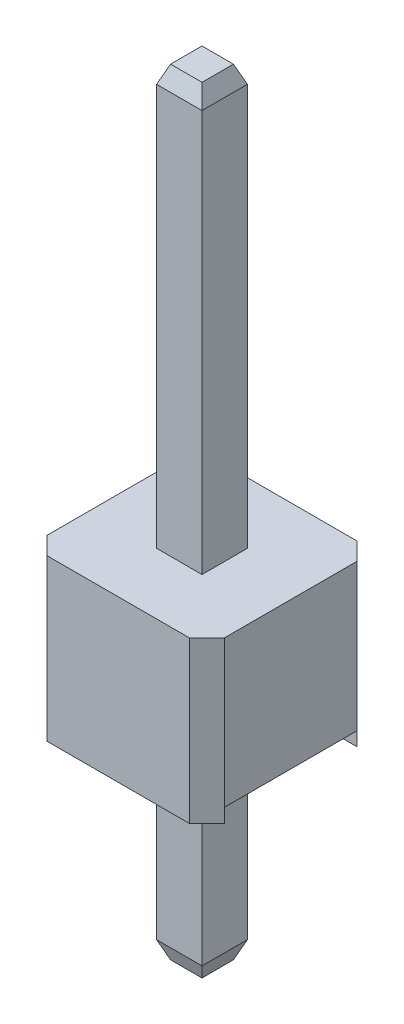
ISO-10303-21;
HEADER;
FILE_DESCRIPTION(('STEP AP214'),'2;1');
FILE_NAME('part.step','',(''),(''),'','','');
FILE_SCHEMA(('AUTOMOTIVE_DESIGN { 1 0 10303 214 1 1 1 1 }'));
ENDSEC;
DATA;
#1=APPLICATION_CONTEXT('core data for automotive mechanical design processes');
#2=APPLICATION_PROTOCOL_DEFINITION('international standard','automotive_design',2000,#1);
#3=PRODUCT_CONTEXT('',#1,'mechanical');
#4=PRODUCT('Part','Part','',(#3));
#5=PRODUCT_RELATED_PRODUCT_CATEGORY('part','',(#4));
#6=PRODUCT_DEFINITION_FORMATION('','',#4);
#7=PRODUCT_DEFINITION_CONTEXT('part definition',#1,'design');
#8=PRODUCT_DEFINITION('design','',#6,#7);
#9=PRODUCT_DEFINITION_SHAPE('','',#8);
#10=(LENGTH_UNIT() NAMED_UNIT(*) SI_UNIT(.MILLI.,.METRE.));
#11=(NAMED_UNIT(*) PLANE_ANGLE_UNIT() SI_UNIT($,.RADIAN.));
#12=(NAMED_UNIT(*) SI_UNIT($,.STERADIAN.) SOLID_ANGLE_UNIT());
#13=UNCERTAINTY_MEASURE_WITH_UNIT(LENGTH_MEASURE(1.E-05),#10,'distance_accuracy_value','');
#14=(GEOMETRIC_REPRESENTATION_CONTEXT(3) GLOBAL_UNCERTAINTY_ASSIGNED_CONTEXT((#13)) GLOBAL_UNIT_ASSIGNED_CONTEXT((#10,
#11,#12)) REPRESENTATION_CONTEXT('',''));
#15=CARTESIAN_POINT('',(0.,0.,0.));
#16=DIRECTION('',(0.,0.,1.));
#17=DIRECTION('',(1.,0.,0.));
#18=AXIS2_PLACEMENT_3D('',#15,#16,#17);
#19=CARTESIAN_POINT('',(-4.405,3.2,1.275));
#20=DIRECTION('',(0.,1.,0.));
#21=DIRECTION('',(1.,0.,0.));
#22=AXIS2_PLACEMENT_3D('',#19,#20,#21);
#23=PLANE('',#22);
#24=DIRECTION('',(0.,0.,-1.));
#25=VECTOR('',#24,1.);
#26=CARTESIAN_POINT('',(-0.945,3.2,-0.875));
#27=LINE('',#26,#25);
#28=CARTESIAN_POINT('',(-0.945,3.2,1.275));
#29=VERTEX_POINT('',#28);
#30=CARTESIAN_POINT('',(-0.945,3.2,-0.625));
#31=VERTEX_POINT('',#30);
#32=EDGE_CURVE('E11',#29,#31,#27,.T.);
#33=ORIENTED_EDGE('',*,*,#32,.T.);
#34=DIRECTION('',(1.,0.,0.));
#35=VECTOR('',#34,1.);
#36=CARTESIAN_POINT('',(-4.405,3.2,-0.625));
#37=LINE('',#36,#35);
#38=CARTESIAN_POINT('',(1.595,3.2,-0.625));
#39=VERTEX_POINT('',#38);
#40=EDGE_CURVE('E28',#31,#39,#37,.T.);
#41=ORIENTED_EDGE('',*,*,#40,.T.);
#42=DIRECTION('',(0.,0.,1.));
#43=VECTOR('',#42,1.);
#44=CARTESIAN_POINT('',(1.595,3.2,1.275));
#45=LINE('',#44,#43);
#46=CARTESIAN_POINT('',(1.595,3.2,1.275));
#47=VERTEX_POINT('',#46);
#48=EDGE_CURVE('E278',#39,#47,#45,.T.);
#49=ORIENTED_EDGE('',*,*,#48,.T.);
#50=DIRECTION('',(1.,0.,0.));
#51=VECTOR('',#50,1.);
#52=CARTESIAN_POINT('',(-4.405,3.2,1.275));
#53=LINE('',#52,#51);
#54=EDGE_CURVE('E317',#29,#47,#53,.T.);
#55=ORIENTED_EDGE('',*,*,#54,.F.);
#56=EDGE_LOOP('',(#33,#41,#49,#55));
#57=FACE_BOUND('',#56,.T.);
#58=DIRECTION('',(0.,0.,-1.));
#59=VECTOR('',#58,1.);
#60=CARTESIAN_POINT('',(0.,3.2,0.));
#61=LINE('',#60,#59);
#62=CARTESIAN_POINT('',(0.,3.2,0.65));
#63=VERTEX_POINT('',#62);
#64=CARTESIAN_POINT('',(0.,3.2,0.));
#65=VERTEX_POINT('',#64);
#66=EDGE_CURVE('E346',#63,#65,#61,.T.);
#67=ORIENTED_EDGE('',*,*,#66,.F.);
#68=DIRECTION('',(-1.,0.,0.));
#69=VECTOR('',#68,1.);
#70=CARTESIAN_POINT('',(0.,3.2,0.65));
#71=LINE('',#70,#69);
#72=CARTESIAN_POINT('',(0.65,3.2,0.65));
#73=VERTEX_POINT('',#72);
#74=EDGE_CURVE('E312',#73,#63,#71,.T.);
#75=ORIENTED_EDGE('',*,*,#74,.F.);
#76=DIRECTION('',(0.,0.,1.));
#77=VECTOR('',#76,1.);
#78=CARTESIAN_POINT('',(0.65,3.2,0.));
#79=LINE('',#78,#77);
#80=CARTESIAN_POINT('',(0.65,3.2,0.));
#81=VERTEX_POINT('',#80);
#82=EDGE_CURVE('E292',#81,#73,#79,.T.);
#83=ORIENTED_EDGE('',*,*,#82,.F.);
#84=DIRECTION('',(1.,0.,0.));
#85=VECTOR('',#84,1.);
#86=CARTESIAN_POINT('',(0.,3.2,0.));
#87=LINE('',#86,#85);
#88=EDGE_CURVE('E21',#65,#81,#87,.T.);
#89=ORIENTED_EDGE('',*,*,#88,.F.);
#90=EDGE_LOOP('',(#67,#75,#83,#89));
#91=FACE_BOUND('',#90,.T.);
#92=ADVANCED_FACE('F17',(#57,#91),#23,.F.);
#93=CARTESIAN_POINT('',(0.,3.,0.));
#94=DIRECTION('',(0.,-1.,0.));
#95=DIRECTION('',(0.,0.,-1.));
#96=AXIS2_PLACEMENT_3D('',#93,#94,#95);
#97=PLANE('',#96);
#98=DIRECTION('',(1.,0.,0.));
#99=VECTOR('',#98,1.);
#100=CARTESIAN_POINT('',(-4.405,3.,1.275));
#101=LINE('',#100,#99);
#102=CARTESIAN_POINT('',(-0.945,3.,1.275));
#103=VERTEX_POINT('',#102);
#104=CARTESIAN_POINT('',(1.595,3.,1.275));
#105=VERTEX_POINT('',#104);
#106=EDGE_CURVE('E282',#103,#105,#101,.T.);
#107=ORIENTED_EDGE('',*,*,#106,.T.);
#108=DIRECTION('',(-0.70710678118655,0.,0.707106781186545));
#109=VECTOR('',#108,1.);
#110=CARTESIAN_POINT('',(1.435,3.,1.435));
#111=LINE('',#110,#109);
#112=CARTESIAN_POINT('',(1.345,3.,1.525));
#113=VERTEX_POINT('',#112);
#114=EDGE_CURVE('E353',#105,#113,#111,.T.);
#115=ORIENTED_EDGE('',*,*,#114,.T.);
#116=DIRECTION('',(-1.,0.,0.));
#117=VECTOR('',#116,1.);
#118=CARTESIAN_POINT('',(1.595,3.,1.525));
#119=LINE('',#118,#117);
#120=CARTESIAN_POINT('',(-0.695,3.,1.525));
#121=VERTEX_POINT('',#120);
#122=EDGE_CURVE('E255',#113,#121,#119,.T.);
#123=ORIENTED_EDGE('',*,*,#122,.T.);
#124=DIRECTION('',(-0.707106781186548,0.,-0.707106781186548));
#125=VECTOR('',#124,1.);
#126=CARTESIAN_POINT('',(-1.11,3.,1.11));
#127=LINE('',#126,#125);
#128=EDGE_CURVE('E354',#121,#103,#127,.T.);
#129=ORIENTED_EDGE('',*,*,#128,.T.);
#130=EDGE_LOOP('',(#107,#115,#123,#129));
#131=FACE_BOUND('',#130,.T.);
#132=ADVANCED_FACE('F515',(#131),#97,.T.);
#133=CARTESIAN_POINT('',(0.,11.3,0.));
#134=DIRECTION('',(1.,0.,0.));
#135=DIRECTION('',(0.,1.,0.));
#136=AXIS2_PLACEMENT_3D('',#133,#134,#135);
#137=PLANE('',#136);
#138=DIRECTION('',(0.,0.,-1.));
#139=VECTOR('',#138,1.);
#140=CARTESIAN_POINT('',(0.,5.3,0.));
#141=LINE('',#140,#139);
#142=CARTESIAN_POINT('',(0.,5.3,0.65));
#143=VERTEX_POINT('',#142);
#144=CARTESIAN_POINT('',(0.,5.3,0.));
#145=VERTEX_POINT('',#144);
#146=EDGE_CURVE('E359',#143,#145,#141,.T.);
#147=ORIENTED_EDGE('',*,*,#146,.F.);
#148=DIRECTION('',(0.,-1.,0.));
#149=VECTOR('',#148,1.);
#150=CARTESIAN_POINT('',(0.,11.3,0.65));
#151=LINE('',#150,#149);
#152=CARTESIAN_POINT('',(0.,11.05,0.65));
#153=VERTEX_POINT('',#152);
#154=EDGE_CURVE('E368',#153,#143,#151,.T.);
#155=ORIENTED_EDGE('',*,*,#154,.F.);
#156=DIRECTION('',(0.,0.,-1.));
#157=VECTOR('',#156,1.);
#158=CARTESIAN_POINT('',(0.,11.05,0.));
#159=LINE('',#158,#157);
#160=CARTESIAN_POINT('',(0.,11.05,0.));
#161=VERTEX_POINT('',#160);
#162=EDGE_CURVE('E402',#153,#161,#159,.T.);
#163=ORIENTED_EDGE('',*,*,#162,.T.);
#164=DIRECTION('',(0.,-1.,0.));
#165=VECTOR('',#164,1.);
#166=CARTESIAN_POINT('',(0.,11.3,0.));
#167=LINE('',#166,#165);
#168=EDGE_CURVE('E398',#161,#145,#167,.T.);
#169=ORIENTED_EDGE('',*,*,#168,.T.);
#170=EDGE_LOOP('',(#147,#155,#163,#169));
#171=FACE_BOUND('',#170,.T.);
#172=ADVANCED_FACE('F884',(#171),#137,.F.);
#173=CARTESIAN_POINT('',(0.,11.3,0.65));
#174=DIRECTION('',(0.,0.,-1.));
#175=DIRECTION('',(0.,-1.,0.));
#176=AXIS2_PLACEMENT_3D('',#173,#174,#175);
#177=PLANE('',#176);
#178=DIRECTION('',(-1.,0.,0.));
#179=VECTOR('',#178,1.);
#180=CARTESIAN_POINT('',(0.,5.3,0.65));
#181=LINE('',#180,#179);
#182=CARTESIAN_POINT('',(0.65,5.3,0.65));
#183=VERTEX_POINT('',#182);
#184=EDGE_CURVE('E355',#183,#143,#181,.T.);
#185=ORIENTED_EDGE('',*,*,#184,.F.);
#186=DIRECTION('',(0.,-1.,0.));
#187=VECTOR('',#186,1.);
#188=CARTESIAN_POINT('',(0.65,11.3,0.65));
#189=LINE('',#188,#187);
#190=CARTESIAN_POINT('',(0.65,11.05,0.65));
#191=VERTEX_POINT('',#190);
#192=EDGE_CURVE('E298',#191,#183,#189,.T.);
#193=ORIENTED_EDGE('',*,*,#192,.F.);
#194=DIRECTION('',(-1.,0.,0.));
#195=VECTOR('',#194,1.);
#196=CARTESIAN_POINT('',(0.,11.05,0.65));
#197=LINE('',#196,#195);
#198=EDGE_CURVE('E372',#191,#153,#197,.T.);
#199=ORIENTED_EDGE('',*,*,#198,.T.);
#200=ORIENTED_EDGE('',*,*,#154,.T.);
#201=EDGE_LOOP('',(#185,#193,#199,#200));
#202=FACE_BOUND('',#201,.T.);
#203=ADVANCED_FACE('F834',(#202),#177,.F.);
#204=CARTESIAN_POINT('',(0.65,11.3,0.));
#205=DIRECTION('',(-1.,0.,0.));
#206=DIRECTION('',(0.,1.,0.));
#207=AXIS2_PLACEMENT_3D('',#204,#205,#206);
#208=PLANE('',#207);
#209=DIRECTION('',(0.,0.,1.));
#210=VECTOR('',#209,1.);
#211=CARTESIAN_POINT('',(0.65,5.3,0.));
#212=LINE('',#211,#210);
#213=CARTESIAN_POINT('',(0.65,5.3,0.));
#214=VERTEX_POINT('',#213);
#215=EDGE_CURVE('E417',#214,#183,#212,.T.);
#216=ORIENTED_EDGE('',*,*,#215,.F.);
#217=DIRECTION('',(0.,-1.,0.));
#218=VECTOR('',#217,1.);
#219=CARTESIAN_POINT('',(0.65,11.3,0.));
#220=LINE('',#219,#218);
#221=CARTESIAN_POINT('',(0.65,11.05,0.));
#222=VERTEX_POINT('',#221);
#223=EDGE_CURVE('E299',#222,#214,#220,.T.);
#224=ORIENTED_EDGE('',*,*,#223,.F.);
#225=DIRECTION('',(0.,0.,1.));
#226=VECTOR('',#225,1.);
#227=CARTESIAN_POINT('',(0.65,11.05,0.65));
#228=LINE('',#227,#226);
#229=EDGE_CURVE('E350',#222,#191,#228,.T.);
#230=ORIENTED_EDGE('',*,*,#229,.T.);
#231=ORIENTED_EDGE('',*,*,#192,.T.);
#232=EDGE_LOOP('',(#216,#224,#230,#231));
#233=FACE_BOUND('',#232,.T.);
#234=ADVANCED_FACE('F829',(#233),#208,.F.);
#235=CARTESIAN_POINT('',(0.,11.3,0.));
#236=DIRECTION('',(0.,0.,1.));
#237=DIRECTION('',(1.,0.,0.));
#238=AXIS2_PLACEMENT_3D('',#235,#236,#237);
#239=PLANE('',#238);
#240=DIRECTION('',(1.,0.,0.));
#241=VECTOR('',#240,1.);
#242=CARTESIAN_POINT('',(0.,5.3,0.));
#243=LINE('',#242,#241);
#244=EDGE_CURVE('E418',#145,#214,#243,.T.);
#245=ORIENTED_EDGE('',*,*,#244,.F.);
#246=ORIENTED_EDGE('',*,*,#168,.F.);
#247=DIRECTION('',(1.,0.,0.));
#248=VECTOR('',#247,1.);
#249=CARTESIAN_POINT('',(0.65,11.05,0.));
#250=LINE('',#249,#248);
#251=EDGE_CURVE('E294',#161,#222,#250,.T.);
#252=ORIENTED_EDGE('',*,*,#251,.T.);
#253=ORIENTED_EDGE('',*,*,#223,.T.);
#254=EDGE_LOOP('',(#245,#246,#252,#253));
#255=FACE_BOUND('',#254,.T.);
#256=ADVANCED_FACE('F833',(#255),#239,.F.);
#257=CARTESIAN_POINT('',(0.,11.3,0.));
#258=DIRECTION('',(0.,1.,0.));
#259=DIRECTION('',(1.,0.,0.));
#260=AXIS2_PLACEMENT_3D('',#257,#258,#259);
#261=PLANE('',#260);
#262=DIRECTION('',(0.,0.,-1.));
#263=VECTOR('',#262,1.);
#264=CARTESIAN_POINT('',(0.55,11.3,0.));
#265=LINE('',#264,#263);
#266=CARTESIAN_POINT('',(0.55,11.3,0.55));
#267=VERTEX_POINT('',#266);
#268=CARTESIAN_POINT('',(0.55,11.3,0.1));
#269=VERTEX_POINT('',#268);
#270=EDGE_CURVE('E304',#267,#269,#265,.T.);
#271=ORIENTED_EDGE('',*,*,#270,.T.);
#272=DIRECTION('',(-1.,0.,0.));
#273=VECTOR('',#272,1.);
#274=CARTESIAN_POINT('',(0.,11.3,0.1));
#275=LINE('',#274,#273);
#276=CARTESIAN_POINT('',(0.1,11.3,0.1));
#277=VERTEX_POINT('',#276);
#278=EDGE_CURVE('E300',#269,#277,#275,.T.);
#279=ORIENTED_EDGE('',*,*,#278,.T.);
#280=DIRECTION('',(0.,0.,1.));
#281=VECTOR('',#280,1.);
#282=CARTESIAN_POINT('',(0.1,11.3,0.65));
#283=LINE('',#282,#281);
#284=CARTESIAN_POINT('',(0.1,11.3,0.55));
#285=VERTEX_POINT('',#284);
#286=EDGE_CURVE('E305',#277,#285,#283,.T.);
#287=ORIENTED_EDGE('',*,*,#286,.T.);
#288=DIRECTION('',(1.,0.,0.));
#289=VECTOR('',#288,1.);
#290=CARTESIAN_POINT('',(0.65,11.3,0.55));
#291=LINE('',#290,#289);
#292=EDGE_CURVE('E412',#285,#267,#291,.T.);
#293=ORIENTED_EDGE('',*,*,#292,.T.);
#294=EDGE_LOOP('',(#271,#279,#287,#293));
#295=FACE_BOUND('',#294,.T.);
#296=ADVANCED_FACE('F951',(#295),#261,.T.);
#297=CARTESIAN_POINT('',(0.,11.3,0.55));
#298=DIRECTION('',(0.,0.371390676354102,0.92847669088526));
#299=DIRECTION('',(1.,0.,0.));
#300=AXIS2_PLACEMENT_3D('',#297,#298,#299);
#301=PLANE('',#300);
#302=DIRECTION('',(0.348155311911395,0.87038827977849,-0.348155311911395));
#303=VECTOR('',#302,1.);
#304=CARTESIAN_POINT('',(0.166666666666666,11.4666666666667,0.483333333333334));
#305=LINE('',#304,#303);
#306=EDGE_CURVE('E430',#153,#285,#305,.T.);
#307=ORIENTED_EDGE('',*,*,#306,.F.);
#308=ORIENTED_EDGE('',*,*,#198,.F.);
#309=DIRECTION('',(0.348155311911395,-0.87038827977849,0.348155311911395));
#310=VECTOR('',#309,1.);
#311=CARTESIAN_POINT('',(0.483333333333334,11.4666666666667,0.483333333333334));
#312=LINE('',#311,#310);
#313=EDGE_CURVE('E434',#267,#191,#312,.T.);
#314=ORIENTED_EDGE('',*,*,#313,.F.);
#315=ORIENTED_EDGE('',*,*,#292,.F.);
#316=EDGE_LOOP('',(#307,#308,#314,#315));
#317=FACE_BOUND('',#316,.T.);
#318=ADVANCED_FACE('F955',(#317),#301,.T.);
#319=CARTESIAN_POINT('',(0.55,11.3,0.));
#320=DIRECTION('',(0.92847669088526,0.371390676354102,0.));
#321=DIRECTION('',(0.,0.,-1.));
#322=AXIS2_PLACEMENT_3D('',#319,#320,#321);
#323=PLANE('',#322);
#324=ORIENTED_EDGE('',*,*,#313,.T.);
#325=ORIENTED_EDGE('',*,*,#229,.F.);
#326=DIRECTION('',(0.348155311911395,-0.87038827977849,-0.348155311911395));
#327=VECTOR('',#326,1.);
#328=CARTESIAN_POINT('',(0.562121212121212,11.269696969697,0.0878787878787882));
#329=LINE('',#328,#327);
#330=EDGE_CURVE('E435',#269,#222,#329,.T.);
#331=ORIENTED_EDGE('',*,*,#330,.F.);
#332=ORIENTED_EDGE('',*,*,#270,.F.);
#333=EDGE_LOOP('',(#324,#325,#331,#332));
#334=FACE_BOUND('',#333,.T.);
#335=ADVANCED_FACE('F908',(#334),#323,.T.);
#336=CARTESIAN_POINT('',(0.1,11.3,0.));
#337=DIRECTION('',(-0.92847669088526,0.371390676354102,0.));
#338=DIRECTION('',(0.,0.,1.));
#339=AXIS2_PLACEMENT_3D('',#336,#337,#338);
#340=PLANE('',#339);
#341=ORIENTED_EDGE('',*,*,#306,.T.);
#342=ORIENTED_EDGE('',*,*,#286,.F.);
#343=DIRECTION('',(0.348155311911395,0.87038827977849,0.348155311911395));
#344=VECTOR('',#343,1.);
#345=CARTESIAN_POINT('',(0.0878787878787882,11.269696969697,0.0878787878787882));
#346=LINE('',#345,#344);
#347=EDGE_CURVE('E390',#161,#277,#346,.T.);
#348=ORIENTED_EDGE('',*,*,#347,.F.);
#349=ORIENTED_EDGE('',*,*,#162,.F.);
#350=EDGE_LOOP('',(#341,#342,#348,#349));
#351=FACE_BOUND('',#350,.T.);
#352=ADVANCED_FACE('F903',(#351),#340,.T.);
#353=CARTESIAN_POINT('',(0.,11.3,0.1));
#354=DIRECTION('',(0.,0.371390676354102,-0.92847669088526));
#355=DIRECTION('',(-1.,0.,0.));
#356=AXIS2_PLACEMENT_3D('',#353,#354,#355);
#357=PLANE('',#356);
#358=ORIENTED_EDGE('',*,*,#330,.T.);
#359=ORIENTED_EDGE('',*,*,#251,.F.);
#360=ORIENTED_EDGE('',*,*,#347,.T.);
#361=ORIENTED_EDGE('',*,*,#278,.F.);
#362=EDGE_LOOP('',(#358,#359,#360,#361));
#363=FACE_BOUND('',#362,.T.);
#364=ADVANCED_FACE('F907',(#363),#357,.T.);
#365=CARTESIAN_POINT('',(0.,5.3,0.));
#366=DIRECTION('',(0.,-1.,0.));
#367=DIRECTION('',(0.,0.,-1.));
#368=AXIS2_PLACEMENT_3D('',#365,#366,#367);
#369=PLANE('',#368);
#370=DIRECTION('',(1.,0.,0.));
#371=VECTOR('',#370,1.);
#372=CARTESIAN_POINT('',(1.595,5.3,-0.875));
#373=LINE('',#372,#371);
#374=CARTESIAN_POINT('',(-0.695,5.3,-0.875));
#375=VERTEX_POINT('',#374);
#376=CARTESIAN_POINT('',(1.345,5.3,-0.875));
#377=VERTEX_POINT('',#376);
#378=EDGE_CURVE('E364',#375,#377,#373,.T.);
#379=ORIENTED_EDGE('',*,*,#378,.F.);
#380=DIRECTION('',(-0.707106781186548,0.,0.707106781186548));
#381=VECTOR('',#380,1.);
#382=CARTESIAN_POINT('',(-0.945,5.3,-0.625));
#383=LINE('',#382,#381);
#384=CARTESIAN_POINT('',(-0.945,5.3,-0.625));
#385=VERTEX_POINT('',#384);
#386=EDGE_CURVE('E387',#375,#385,#383,.T.);
#387=ORIENTED_EDGE('',*,*,#386,.T.);
#388=DIRECTION('',(0.,0.,-1.));
#389=VECTOR('',#388,1.);
#390=CARTESIAN_POINT('',(-0.945,5.3,-0.875));
#391=LINE('',#390,#389);
#392=CARTESIAN_POINT('',(-0.945,5.3,1.275));
#393=VERTEX_POINT('',#392);
#394=EDGE_CURVE('E271',#393,#385,#391,.T.);
#395=ORIENTED_EDGE('',*,*,#394,.F.);
#396=DIRECTION('',(0.707106781186548,0.,0.707106781186548));
#397=VECTOR('',#396,1.);
#398=CARTESIAN_POINT('',(-0.695,5.3,1.525));
#399=LINE('',#398,#397);
#400=CARTESIAN_POINT('',(-0.695,5.3,1.525));
#401=VERTEX_POINT('',#400);
#402=EDGE_CURVE('E235',#393,#401,#399,.T.);
#403=ORIENTED_EDGE('',*,*,#402,.T.);
#404=DIRECTION('',(-1.,0.,0.));
#405=VECTOR('',#404,1.);
#406=CARTESIAN_POINT('',(1.595,5.3,1.525));
#407=LINE('',#406,#405);
#408=CARTESIAN_POINT('',(1.345,5.3,1.525));
#409=VERTEX_POINT('',#408);
#410=EDGE_CURVE('E228',#409,#401,#407,.T.);
#411=ORIENTED_EDGE('',*,*,#410,.F.);
#412=DIRECTION('',(0.70710678118655,0.,-0.707106781186545));
#413=VECTOR('',#412,1.);
#414=CARTESIAN_POINT('',(1.595,5.3,1.275));
#415=LINE('',#414,#413);
#416=CARTESIAN_POINT('',(1.595,5.3,1.275));
#417=VERTEX_POINT('',#416);
#418=EDGE_CURVE('E232',#409,#417,#415,.T.);
#419=ORIENTED_EDGE('',*,*,#418,.T.);
#420=DIRECTION('',(0.,0.,1.));
#421=VECTOR('',#420,1.);
#422=CARTESIAN_POINT('',(1.595,5.3,-0.875));
#423=LINE('',#422,#421);
#424=CARTESIAN_POINT('',(1.595,5.3,-0.625));
#425=VERTEX_POINT('',#424);
#426=EDGE_CURVE('E308',#425,#417,#423,.T.);
#427=ORIENTED_EDGE('',*,*,#426,.F.);
#428=DIRECTION('',(-0.707106781186545,0.,-0.70710678118655));
#429=VECTOR('',#428,1.);
#430=CARTESIAN_POINT('',(1.345,5.3,-0.875));
#431=LINE('',#430,#429);
#432=EDGE_CURVE('E251',#425,#377,#431,.T.);
#433=ORIENTED_EDGE('',*,*,#432,.T.);
#434=EDGE_LOOP('',(#379,#387,#395,#403,#411,#419,#427,#433));
#435=FACE_BOUND('',#434,.T.);
#436=ORIENTED_EDGE('',*,*,#184,.T.);
#437=ORIENTED_EDGE('',*,*,#146,.T.);
#438=ORIENTED_EDGE('',*,*,#244,.T.);
#439=ORIENTED_EDGE('',*,*,#215,.T.);
#440=EDGE_LOOP('',(#436,#437,#438,#439));
#441=FACE_BOUND('',#440,.T.);
#442=ADVANCED_FACE('F19',(#435,#441),#369,.F.);
#443=CARTESIAN_POINT('',(0.,3.,0.));
#444=DIRECTION('',(0.,-1.,0.));
#445=DIRECTION('',(0.,0.,-1.));
#446=AXIS2_PLACEMENT_3D('',#443,#444,#445);
#447=PLANE('',#446);
#448=DIRECTION('',(1.,0.,0.));
#449=VECTOR('',#448,1.);
#450=CARTESIAN_POINT('',(-4.405,3.,-0.625));
#451=LINE('',#450,#449);
#452=CARTESIAN_POINT('',(-0.945,3.,-0.625));
#453=VERTEX_POINT('',#452);
#454=CARTESIAN_POINT('',(1.595,3.,-0.625));
#455=VERTEX_POINT('',#454);
#456=EDGE_CURVE('E159',#453,#455,#451,.T.);
#457=ORIENTED_EDGE('',*,*,#456,.F.);
#458=DIRECTION('',(0.707106781186548,0.,-0.707106781186548));
#459=VECTOR('',#458,1.);
#460=CARTESIAN_POINT('',(-0.785,3.,-0.785));
#461=LINE('',#460,#459);
#462=CARTESIAN_POINT('',(-0.695,3.,-0.875));
#463=VERTEX_POINT('',#462);
#464=EDGE_CURVE('E413',#453,#463,#461,.T.);
#465=ORIENTED_EDGE('',*,*,#464,.T.);
#466=DIRECTION('',(1.,0.,0.));
#467=VECTOR('',#466,1.);
#468=CARTESIAN_POINT('',(1.595,3.,-0.875));
#469=LINE('',#468,#467);
#470=CARTESIAN_POINT('',(1.345,3.,-0.875));
#471=VERTEX_POINT('',#470);
#472=EDGE_CURVE('E315',#463,#471,#469,.T.);
#473=ORIENTED_EDGE('',*,*,#472,.T.);
#474=DIRECTION('',(0.707106781186545,0.,0.70710678118655));
#475=VECTOR('',#474,1.);
#476=CARTESIAN_POINT('',(1.11,3.,-1.11));
#477=LINE('',#476,#475);
#478=EDGE_CURVE('E142',#471,#455,#477,.T.);
#479=ORIENTED_EDGE('',*,*,#478,.T.);
#480=EDGE_LOOP('',(#457,#465,#473,#479));
#481=FACE_BOUND('',#480,.T.);
#482=ADVANCED_FACE('F1007',(#481),#447,.T.);
#483=CARTESIAN_POINT('',(1.595,5.3,-0.875));
#484=DIRECTION('',(1.,0.,0.));
#485=DIRECTION('',(0.,1.,0.));
#486=AXIS2_PLACEMENT_3D('',#483,#484,#485);
#487=PLANE('',#486);
#488=ORIENTED_EDGE('',*,*,#48,.F.);
#489=DIRECTION('',(0.,1.,0.));
#490=VECTOR('',#489,1.);
#491=CARTESIAN_POINT('',(1.595,5.3,-0.625));
#492=LINE('',#491,#490);
#493=EDGE_CURVE('E316',#39,#425,#492,.T.);
#494=ORIENTED_EDGE('',*,*,#493,.T.);
#495=ORIENTED_EDGE('',*,*,#426,.T.);
#496=DIRECTION('',(0.,-1.,0.));
#497=VECTOR('',#496,1.);
#498=CARTESIAN_POINT('',(1.595,5.3,1.275));
#499=LINE('',#498,#497);
#500=EDGE_CURVE('E249',#417,#47,#499,.T.);
#501=ORIENTED_EDGE('',*,*,#500,.T.);
#502=EDGE_LOOP('',(#488,#494,#495,#501));
#503=FACE_BOUND('',#502,.T.);
#504=ADVANCED_FACE('F523',(#503),#487,.T.);
#505=CARTESIAN_POINT('',(1.595,5.3,-0.875));
#506=DIRECTION('',(0.,0.,-1.));
#507=DIRECTION('',(0.,-1.,0.));
#508=AXIS2_PLACEMENT_3D('',#505,#506,#507);
#509=PLANE('',#508);
#510=ORIENTED_EDGE('',*,*,#472,.F.);
#511=DIRECTION('',(0.,1.,0.));
#512=VECTOR('',#511,1.);
#513=CARTESIAN_POINT('',(-0.695,5.3,-0.875));
#514=LINE('',#513,#512);
#515=EDGE_CURVE('E269',#463,#375,#514,.T.);
#516=ORIENTED_EDGE('',*,*,#515,.T.);
#517=ORIENTED_EDGE('',*,*,#378,.T.);
#518=DIRECTION('',(0.,-1.,0.));
#519=VECTOR('',#518,1.);
#520=CARTESIAN_POINT('',(1.345,5.3,-0.875));
#521=LINE('',#520,#519);
#522=EDGE_CURVE('E360',#377,#471,#521,.T.);
#523=ORIENTED_EDGE('',*,*,#522,.T.);
#524=EDGE_LOOP('',(#510,#516,#517,#523));
#525=FACE_BOUND('',#524,.T.);
#526=ADVANCED_FACE('F533',(#525),#509,.T.);
#527=CARTESIAN_POINT('',(-0.945,5.3,-0.875));
#528=DIRECTION('',(-1.,0.,0.));
#529=DIRECTION('',(0.,0.,1.));
#530=AXIS2_PLACEMENT_3D('',#527,#528,#529);
#531=PLANE('',#530);
#532=ORIENTED_EDGE('',*,*,#32,.F.);
#533=DIRECTION('',(0.,1.,0.));
#534=VECTOR('',#533,1.);
#535=CARTESIAN_POINT('',(-0.945,5.3,1.275));
#536=LINE('',#535,#534);
#537=EDGE_CURVE('E274',#29,#393,#536,.T.);
#538=ORIENTED_EDGE('',*,*,#537,.T.);
#539=ORIENTED_EDGE('',*,*,#394,.T.);
#540=DIRECTION('',(0.,-1.,0.));
#541=VECTOR('',#540,1.);
#542=CARTESIAN_POINT('',(-0.945,5.3,-0.625));
#543=LINE('',#542,#541);
#544=EDGE_CURVE('E43',#385,#31,#543,.T.);
#545=ORIENTED_EDGE('',*,*,#544,.T.);
#546=EDGE_LOOP('',(#532,#538,#539,#545));
#547=FACE_BOUND('',#546,.T.);
#548=ADVANCED_FACE('F917',(#547),#531,.T.);
#549=CARTESIAN_POINT('',(1.595,5.3,1.525));
#550=DIRECTION('',(0.,0.,1.));
#551=DIRECTION('',(1.,0.,0.));
#552=AXIS2_PLACEMENT_3D('',#549,#550,#551);
#553=PLANE('',#552);
#554=ORIENTED_EDGE('',*,*,#410,.T.);
#555=DIRECTION('',(0.,-1.,0.));
#556=VECTOR('',#555,1.);
#557=CARTESIAN_POINT('',(-0.695,5.3,1.525));
#558=LINE('',#557,#556);
#559=EDGE_CURVE('E241',#401,#121,#558,.T.);
#560=ORIENTED_EDGE('',*,*,#559,.T.);
#561=ORIENTED_EDGE('',*,*,#122,.F.);
#562=DIRECTION('',(0.,1.,0.));
#563=VECTOR('',#562,1.);
#564=CARTESIAN_POINT('',(1.345,5.3,1.525));
#565=LINE('',#564,#563);
#566=EDGE_CURVE('E246',#113,#409,#565,.T.);
#567=ORIENTED_EDGE('',*,*,#566,.T.);
#568=EDGE_LOOP('',(#554,#560,#561,#567));
#569=FACE_BOUND('',#568,.T.);
#570=ADVANCED_FACE('F253',(#569),#553,.T.);
#571=CARTESIAN_POINT('',(-0.945,5.3,-0.625));
#572=DIRECTION('',(0.707106781186548,0.,0.707106781186548));
#573=DIRECTION('',(0.,-1.,0.));
#574=AXIS2_PLACEMENT_3D('',#571,#572,#573);
#575=PLANE('',#574);
#576=ORIENTED_EDGE('',*,*,#386,.F.);
#577=ORIENTED_EDGE('',*,*,#515,.F.);
#578=ORIENTED_EDGE('',*,*,#464,.F.);
#579=DIRECTION('',(0.,-1.,0.));
#580=VECTOR('',#579,1.);
#581=CARTESIAN_POINT('',(-0.945,5.3,-0.625));
#582=LINE('',#581,#580);
#583=EDGE_CURVE('E258',#31,#453,#582,.T.);
#584=ORIENTED_EDGE('',*,*,#583,.F.);
#585=ORIENTED_EDGE('',*,*,#544,.F.);
#586=EDGE_LOOP('',(#576,#577,#578,#584,#585));
#587=FACE_BOUND('',#586,.T.);
#588=ADVANCED_FACE('F817',(#587),#575,.F.);
#589=CARTESIAN_POINT('',(-0.695,5.3,1.525));
#590=DIRECTION('',(0.707106781186548,0.,-0.707106781186548));
#591=DIRECTION('',(0.,-1.,0.));
#592=AXIS2_PLACEMENT_3D('',#589,#590,#591);
#593=PLANE('',#592);
#594=ORIENTED_EDGE('',*,*,#402,.F.);
#595=ORIENTED_EDGE('',*,*,#537,.F.);
#596=DIRECTION('',(0.,1.,0.));
#597=VECTOR('',#596,1.);
#598=CARTESIAN_POINT('',(-0.945,5.3,1.275));
#599=LINE('',#598,#597);
#600=EDGE_CURVE('E320',#103,#29,#599,.T.);
#601=ORIENTED_EDGE('',*,*,#600,.F.);
#602=ORIENTED_EDGE('',*,*,#128,.F.);
#603=ORIENTED_EDGE('',*,*,#559,.F.);
#604=EDGE_LOOP('',(#594,#595,#601,#602,#603));
#605=FACE_BOUND('',#604,.T.);
#606=ADVANCED_FACE('F821',(#605),#593,.F.);
#607=CARTESIAN_POINT('',(1.595,5.3,1.275));
#608=DIRECTION('',(-0.707106781186545,0.,-0.70710678118655));
#609=DIRECTION('',(-0.70710678118655,0.,0.707106781186545));
#610=AXIS2_PLACEMENT_3D('',#607,#608,#609);
#611=PLANE('',#610);
#612=ORIENTED_EDGE('',*,*,#418,.F.);
#613=ORIENTED_EDGE('',*,*,#566,.F.);
#614=ORIENTED_EDGE('',*,*,#114,.F.);
#615=DIRECTION('',(0.,-1.,0.));
#616=VECTOR('',#615,1.);
#617=CARTESIAN_POINT('',(1.595,3.,1.275));
#618=LINE('',#617,#616);
#619=EDGE_CURVE('E321',#47,#105,#618,.T.);
#620=ORIENTED_EDGE('',*,*,#619,.F.);
#621=ORIENTED_EDGE('',*,*,#500,.F.);
#622=EDGE_LOOP('',(#612,#613,#614,#620,#621));
#623=FACE_BOUND('',#622,.T.);
#624=ADVANCED_FACE('F245',(#623),#611,.F.);
#625=CARTESIAN_POINT('',(1.345,5.3,-0.875));
#626=DIRECTION('',(-0.70710678118655,0.,0.707106781186545));
#627=DIRECTION('',(0.,1.,0.));
#628=AXIS2_PLACEMENT_3D('',#625,#626,#627);
#629=PLANE('',#628);
#630=ORIENTED_EDGE('',*,*,#432,.F.);
#631=ORIENTED_EDGE('',*,*,#493,.F.);
#632=DIRECTION('',(0.,1.,0.));
#633=VECTOR('',#632,1.);
#634=CARTESIAN_POINT('',(1.595,5.3,-0.625));
#635=LINE('',#634,#633);
#636=EDGE_CURVE('E375',#455,#39,#635,.T.);
#637=ORIENTED_EDGE('',*,*,#636,.F.);
#638=ORIENTED_EDGE('',*,*,#478,.F.);
#639=ORIENTED_EDGE('',*,*,#522,.F.);
#640=EDGE_LOOP('',(#630,#631,#637,#638,#639));
#641=FACE_BOUND('',#640,.T.);
#642=ADVANCED_FACE('F528',(#641),#629,.F.);
#643=CARTESIAN_POINT('',(-4.405,3.,-0.625));
#644=DIRECTION('',(0.,0.,-1.));
#645=DIRECTION('',(0.,-1.,0.));
#646=AXIS2_PLACEMENT_3D('',#643,#644,#645);
#647=PLANE('',#646);
#648=ORIENTED_EDGE('',*,*,#583,.T.);
#649=ORIENTED_EDGE('',*,*,#456,.T.);
#650=ORIENTED_EDGE('',*,*,#636,.T.);
#651=ORIENTED_EDGE('',*,*,#40,.F.);
#652=EDGE_LOOP('',(#648,#649,#650,#651));
#653=FACE_BOUND('',#652,.T.);
#654=ADVANCED_FACE('F526',(#653),#647,.F.);
#655=CARTESIAN_POINT('',(-4.405,3.,1.275));
#656=DIRECTION('',(0.,0.,1.));
#657=DIRECTION('',(1.,0.,0.));
#658=AXIS2_PLACEMENT_3D('',#655,#656,#657);
#659=PLANE('',#658);
#660=ORIENTED_EDGE('',*,*,#600,.T.);
#661=ORIENTED_EDGE('',*,*,#54,.T.);
#662=ORIENTED_EDGE('',*,*,#619,.T.);
#663=ORIENTED_EDGE('',*,*,#106,.F.);
#664=EDGE_LOOP('',(#660,#661,#662,#663));
#665=FACE_BOUND('',#664,.T.);
#666=ADVANCED_FACE('F518',(#665),#659,.F.);
#667=CARTESIAN_POINT('',(0.,0.2,0.));
#668=DIRECTION('',(1.,0.,0.));
#669=DIRECTION('',(0.,1.,0.));
#670=AXIS2_PLACEMENT_3D('',#667,#668,#669);
#671=PLANE('',#670);
#672=DIRECTION('',(0.,1.,0.));
#673=VECTOR('',#672,1.);
#674=CARTESIAN_POINT('',(0.,0.2,0.));
#675=LINE('',#674,#673);
#676=CARTESIAN_POINT('',(0.,0.45,0.));
#677=VERTEX_POINT('',#676);
#678=EDGE_CURVE('E322',#677,#65,#675,.T.);
#679=ORIENTED_EDGE('',*,*,#678,.F.);
#680=DIRECTION('',(0.,0.,1.));
#681=VECTOR('',#680,1.);
#682=CARTESIAN_POINT('',(0.,0.45,0.));
#683=LINE('',#682,#681);
#684=CARTESIAN_POINT('',(0.,0.45,0.65));
#685=VERTEX_POINT('',#684);
#686=EDGE_CURVE('E382',#677,#685,#683,.T.);
#687=ORIENTED_EDGE('',*,*,#686,.T.);
#688=DIRECTION('',(0.,1.,0.));
#689=VECTOR('',#688,1.);
#690=CARTESIAN_POINT('',(0.,0.2,0.65));
#691=LINE('',#690,#689);
#692=EDGE_CURVE('E378',#685,#63,#691,.T.);
#693=ORIENTED_EDGE('',*,*,#692,.T.);
#694=ORIENTED_EDGE('',*,*,#66,.T.);
#695=EDGE_LOOP('',(#679,#687,#693,#694));
#696=FACE_BOUND('',#695,.T.);
#697=ADVANCED_FACE('F872',(#696),#671,.F.);
#698=CARTESIAN_POINT('',(0.,0.2,0.));
#699=DIRECTION('',(0.,0.,1.));
#700=DIRECTION('',(1.,0.,0.));
#701=AXIS2_PLACEMENT_3D('',#698,#699,#700);
#702=PLANE('',#701);
#703=DIRECTION('',(0.,1.,0.));
#704=VECTOR('',#703,1.);
#705=CARTESIAN_POINT('',(0.65,0.2,0.));
#706=LINE('',#705,#704);
#707=CARTESIAN_POINT('',(0.65,0.45,0.));
#708=VERTEX_POINT('',#707);
#709=EDGE_CURVE('E439',#708,#81,#706,.T.);
#710=ORIENTED_EDGE('',*,*,#709,.F.);
#711=DIRECTION('',(-1.,0.,0.));
#712=VECTOR('',#711,1.);
#713=CARTESIAN_POINT('',(0.,0.45,0.));
#714=LINE('',#713,#712);
#715=EDGE_CURVE('E325',#708,#677,#714,.T.);
#716=ORIENTED_EDGE('',*,*,#715,.T.);
#717=ORIENTED_EDGE('',*,*,#678,.T.);
#718=ORIENTED_EDGE('',*,*,#88,.T.);
#719=EDGE_LOOP('',(#710,#716,#717,#718));
#720=FACE_BOUND('',#719,.T.);
#721=ADVANCED_FACE('F848',(#720),#702,.F.);
#722=CARTESIAN_POINT('',(0.65,0.2,0.));
#723=DIRECTION('',(-1.,0.,0.));
#724=DIRECTION('',(0.,0.,1.));
#725=AXIS2_PLACEMENT_3D('',#722,#723,#724);
#726=PLANE('',#725);
#727=DIRECTION('',(0.,1.,0.));
#728=VECTOR('',#727,1.);
#729=CARTESIAN_POINT('',(0.65,0.2,0.65));
#730=LINE('',#729,#728);
#731=CARTESIAN_POINT('',(0.65,0.45,0.65));
#732=VERTEX_POINT('',#731);
#733=EDGE_CURVE('E293',#732,#73,#730,.T.);
#734=ORIENTED_EDGE('',*,*,#733,.F.);
#735=DIRECTION('',(0.,0.,-1.));
#736=VECTOR('',#735,1.);
#737=CARTESIAN_POINT('',(0.65,0.45,0.));
#738=LINE('',#737,#736);
#739=EDGE_CURVE('E481',#732,#708,#738,.T.);
#740=ORIENTED_EDGE('',*,*,#739,.T.);
#741=ORIENTED_EDGE('',*,*,#709,.T.);
#742=ORIENTED_EDGE('',*,*,#82,.T.);
#743=EDGE_LOOP('',(#734,#740,#741,#742));
#744=FACE_BOUND('',#743,.T.);
#745=ADVANCED_FACE('F843',(#744),#726,.F.);
#746=CARTESIAN_POINT('',(0.,0.2,0.65));
#747=DIRECTION('',(0.,0.,-1.));
#748=DIRECTION('',(0.,-1.,0.));
#749=AXIS2_PLACEMENT_3D('',#746,#747,#748);
#750=PLANE('',#749);
#751=ORIENTED_EDGE('',*,*,#692,.F.);
#752=DIRECTION('',(1.,0.,0.));
#753=VECTOR('',#752,1.);
#754=CARTESIAN_POINT('',(0.,0.45,0.65));
#755=LINE('',#754,#753);
#756=EDGE_CURVE('E288',#685,#732,#755,.T.);
#757=ORIENTED_EDGE('',*,*,#756,.T.);
#758=ORIENTED_EDGE('',*,*,#733,.T.);
#759=ORIENTED_EDGE('',*,*,#74,.T.);
#760=EDGE_LOOP('',(#751,#757,#758,#759));
#761=FACE_BOUND('',#760,.T.);
#762=ADVANCED_FACE('F847',(#761),#750,.F.);
#763=CARTESIAN_POINT('',(0.,0.2,0.));
#764=DIRECTION('',(0.,1.,0.));
#765=DIRECTION('',(1.,0.,0.));
#766=AXIS2_PLACEMENT_3D('',#763,#764,#765);
#767=PLANE('',#766);
#768=DIRECTION('',(0.,0.,1.));
#769=VECTOR('',#768,1.);
#770=CARTESIAN_POINT('',(0.55,0.2,0.));
#771=LINE('',#770,#769);
#772=CARTESIAN_POINT('',(0.55,0.2,0.1));
#773=VERTEX_POINT('',#772);
#774=CARTESIAN_POINT('',(0.55,0.2,0.55));
#775=VERTEX_POINT('',#774);
#776=EDGE_CURVE('E367',#773,#775,#771,.T.);
#777=ORIENTED_EDGE('',*,*,#776,.T.);
#778=DIRECTION('',(-1.,0.,0.));
#779=VECTOR('',#778,1.);
#780=CARTESIAN_POINT('',(0.,0.2,0.55));
#781=LINE('',#780,#779);
#782=CARTESIAN_POINT('',(0.1,0.2,0.55));
#783=VERTEX_POINT('',#782);
#784=EDGE_CURVE('E383',#775,#783,#781,.T.);
#785=ORIENTED_EDGE('',*,*,#784,.T.);
#786=DIRECTION('',(0.,0.,-1.));
#787=VECTOR('',#786,1.);
#788=CARTESIAN_POINT('',(0.1,0.2,0.));
#789=LINE('',#788,#787);
#790=CARTESIAN_POINT('',(0.1,0.2,0.1));
#791=VERTEX_POINT('',#790);
#792=EDGE_CURVE('E286',#783,#791,#789,.T.);
#793=ORIENTED_EDGE('',*,*,#792,.T.);
#794=DIRECTION('',(1.,0.,0.));
#795=VECTOR('',#794,1.);
#796=CARTESIAN_POINT('',(0.,0.2,0.1));
#797=LINE('',#796,#795);
#798=EDGE_CURVE('E283',#791,#773,#797,.T.);
#799=ORIENTED_EDGE('',*,*,#798,.T.);
#800=EDGE_LOOP('',(#777,#785,#793,#799));
#801=FACE_BOUND('',#800,.T.);
#802=ADVANCED_FACE('F942',(#801),#767,.F.);
#803=CARTESIAN_POINT('',(0.,0.2,0.1));
#804=DIRECTION('',(0.,0.371390676354102,0.92847669088526));
#805=DIRECTION('',(1.,0.,0.));
#806=AXIS2_PLACEMENT_3D('',#803,#804,#805);
#807=PLANE('',#806);
#808=DIRECTION('',(0.348155311911395,-0.87038827977849,0.348155311911395));
#809=VECTOR('',#808,1.);
#810=CARTESIAN_POINT('',(0.0878787878787882,0.23030303030303,0.0878787878787882));
#811=LINE('',#810,#809);
#812=EDGE_CURVE('E336',#677,#791,#811,.T.);
#813=ORIENTED_EDGE('',*,*,#812,.F.);
#814=ORIENTED_EDGE('',*,*,#715,.F.);
#815=DIRECTION('',(0.348155311911395,0.87038827977849,-0.348155311911395));
#816=VECTOR('',#815,1.);
#817=CARTESIAN_POINT('',(0.483333333333334,0.0333333333333339,0.166666666666666));
#818=LINE('',#817,#816);
#819=EDGE_CURVE('E287',#773,#708,#818,.T.);
#820=ORIENTED_EDGE('',*,*,#819,.F.);
#821=ORIENTED_EDGE('',*,*,#798,.F.);
#822=EDGE_LOOP('',(#813,#814,#820,#821));
#823=FACE_BOUND('',#822,.T.);
#824=ADVANCED_FACE('F1053',(#823),#807,.F.);
#825=CARTESIAN_POINT('',(0.55,0.2,0.));
#826=DIRECTION('',(-0.92847669088526,0.371390676354102,0.));
#827=DIRECTION('',(0.,0.,1.));
#828=AXIS2_PLACEMENT_3D('',#825,#826,#827);
#829=PLANE('',#828);
#830=ORIENTED_EDGE('',*,*,#819,.T.);
#831=ORIENTED_EDGE('',*,*,#739,.F.);
#832=DIRECTION('',(0.348155311911395,0.87038827977849,0.348155311911395));
#833=VECTOR('',#832,1.);
#834=CARTESIAN_POINT('',(0.483333333333334,0.0333333333333339,0.483333333333334));
#835=LINE('',#834,#833);
#836=EDGE_CURVE('E329',#775,#732,#835,.T.);
#837=ORIENTED_EDGE('',*,*,#836,.F.);
#838=ORIENTED_EDGE('',*,*,#776,.F.);
#839=EDGE_LOOP('',(#830,#831,#837,#838));
#840=FACE_BOUND('',#839,.T.);
#841=ADVANCED_FACE('F978',(#840),#829,.F.);
#842=CARTESIAN_POINT('',(0.1,0.2,0.));
#843=DIRECTION('',(0.92847669088526,0.371390676354102,0.));
#844=DIRECTION('',(0.,0.,-1.));
#845=AXIS2_PLACEMENT_3D('',#842,#843,#844);
#846=PLANE('',#845);
#847=ORIENTED_EDGE('',*,*,#812,.T.);
#848=ORIENTED_EDGE('',*,*,#792,.F.);
#849=DIRECTION('',(0.348155311911395,-0.87038827977849,-0.348155311911395));
#850=VECTOR('',#849,1.);
#851=CARTESIAN_POINT('',(0.166666666666666,0.0333333333333339,0.483333333333334));
#852=LINE('',#851,#850);
#853=EDGE_CURVE('E326',#685,#783,#852,.T.);
#854=ORIENTED_EDGE('',*,*,#853,.F.);
#855=ORIENTED_EDGE('',*,*,#686,.F.);
#856=EDGE_LOOP('',(#847,#848,#854,#855));
#857=FACE_BOUND('',#856,.T.);
#858=ADVANCED_FACE('F861',(#857),#846,.F.);
#859=CARTESIAN_POINT('',(0.,0.2,0.55));
#860=DIRECTION('',(0.,0.371390676354102,-0.92847669088526));
#861=DIRECTION('',(-1.,0.,0.));
#862=AXIS2_PLACEMENT_3D('',#859,#860,#861);
#863=PLANE('',#862);
#864=ORIENTED_EDGE('',*,*,#836,.T.);
#865=ORIENTED_EDGE('',*,*,#756,.F.);
#866=ORIENTED_EDGE('',*,*,#853,.T.);
#867=ORIENTED_EDGE('',*,*,#784,.F.);
#868=EDGE_LOOP('',(#864,#865,#866,#867));
#869=FACE_BOUND('',#868,.T.);
#870=ADVANCED_FACE('F857',(#869),#863,.F.);
#871=CLOSED_SHELL('',(#92,#132,#172,#203,#234,#256,#296,#318,#335,#352,#364,#442,#482,#504,#526,
#548,#570,#588,#606,#624,#642,#654,#666,#697,#721,#745,#762,#802,#824,#841,#858,#870));
#872=MANIFOLD_SOLID_BREP('B1',#871);
#873=ADVANCED_BREP_SHAPE_REPRESENTATION('',(#18,#872),#14);
#874=SHAPE_DEFINITION_REPRESENTATION(#9,#873);
ENDSEC;
END-ISO-10303-21;
